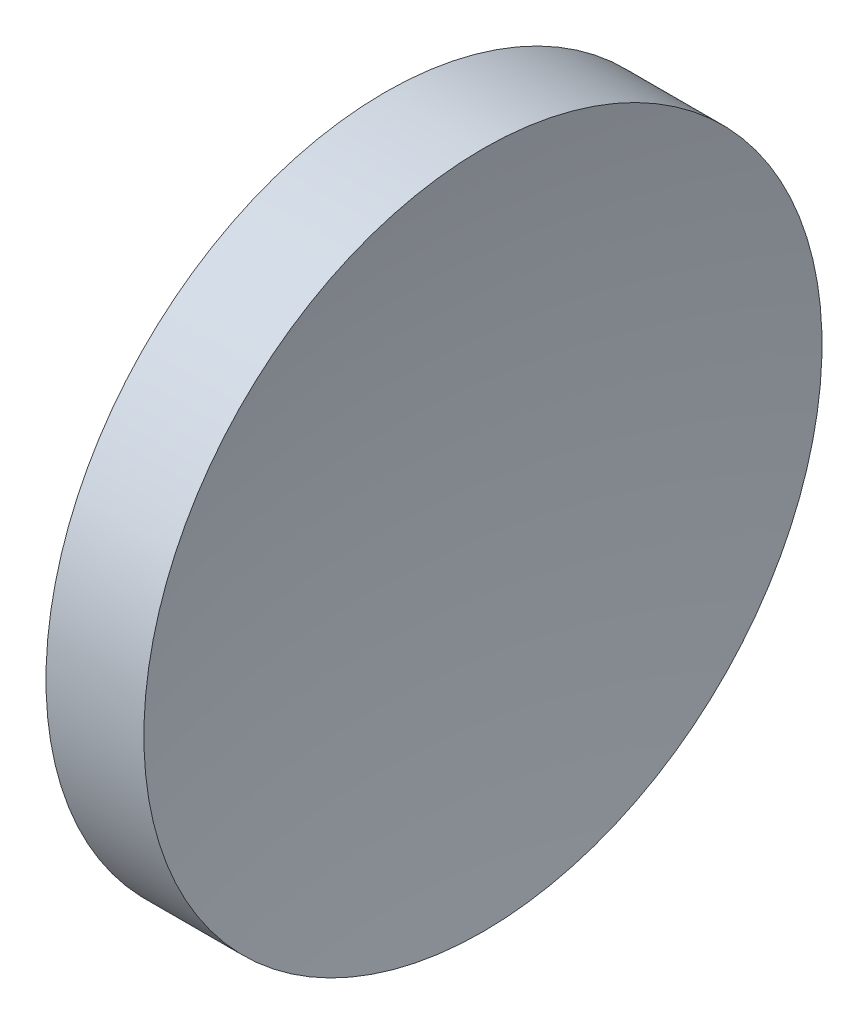
ISO-10303-21;
HEADER;
FILE_DESCRIPTION(('STEP AP214'),'2;1');
FILE_NAME('part.step','',(''),(''),'','','');
FILE_SCHEMA(('AUTOMOTIVE_DESIGN { 1 0 10303 214 1 1 1 1 }'));
ENDSEC;
DATA;
#1=APPLICATION_CONTEXT('core data for automotive mechanical design processes');
#2=APPLICATION_PROTOCOL_DEFINITION('international standard','automotive_design',2000,#1);
#3=PRODUCT_CONTEXT('',#1,'mechanical');
#4=PRODUCT('Part','Part','',(#3));
#5=PRODUCT_RELATED_PRODUCT_CATEGORY('part','',(#4));
#6=PRODUCT_DEFINITION_FORMATION('','',#4);
#7=PRODUCT_DEFINITION_CONTEXT('part definition',#1,'design');
#8=PRODUCT_DEFINITION('design','',#6,#7);
#9=PRODUCT_DEFINITION_SHAPE('','',#8);
#10=(LENGTH_UNIT() NAMED_UNIT(*) SI_UNIT(.MILLI.,.METRE.));
#11=(NAMED_UNIT(*) PLANE_ANGLE_UNIT() SI_UNIT($,.RADIAN.));
#12=(NAMED_UNIT(*) SI_UNIT($,.STERADIAN.) SOLID_ANGLE_UNIT());
#13=UNCERTAINTY_MEASURE_WITH_UNIT(LENGTH_MEASURE(1.E-05),#10,'distance_accuracy_value','');
#14=(GEOMETRIC_REPRESENTATION_CONTEXT(3) GLOBAL_UNCERTAINTY_ASSIGNED_CONTEXT((#13)) GLOBAL_UNIT_ASSIGNED_CONTEXT((#10,
#11,#12)) REPRESENTATION_CONTEXT('',''));
#15=CARTESIAN_POINT('',(0.,0.,0.));
#16=DIRECTION('',(0.,0.,1.));
#17=DIRECTION('',(1.,0.,0.));
#18=AXIS2_PLACEMENT_3D('',#15,#16,#17);
#19=CARTESIAN_POINT('',(206.236171093324,65.1574518265862,0.));
#20=DIRECTION('',(-1.,0.,0.));
#21=DIRECTION('',(0.,-1.,0.));
#22=AXIS2_PLACEMENT_3D('',#19,#20,#21);
#23=SPHERICAL_SURFACE('',#22,88.);
#24=CARTESIAN_POINT('',(119.893829220984,65.1574518265862,0.));
#25=DIRECTION('',(-1.,0.,0.));
#26=DIRECTION('',(0.,-1.,0.));
#27=AXIS2_PLACEMENT_3D('',#24,#25,#26);
#28=CIRCLE('',#27,17.);
#29=CARTESIAN_POINT('',(119.893829220984,48.1574518265862,0.));
#30=VERTEX_POINT('',#29);
#31=EDGE_CURVE('E10',#30,#30,#28,.T.);
#32=ORIENTED_EDGE('',*,*,#31,.F.);
#33=EDGE_LOOP('',(#32));
#34=FACE_BOUND('',#33,.T.);
#35=ADVANCED_FACE('F35',(#34),#23,.F.);
#36=CARTESIAN_POINT('',(110.014789248842,65.1574518265862,0.));
#37=DIRECTION('',(-1.,0.,0.));
#38=DIRECTION('',(0.,-1.,0.));
#39=AXIS2_PLACEMENT_3D('',#36,#37,#38);
#40=CYLINDRICAL_SURFACE('',#39,17.);
#41=CARTESIAN_POINT('',(114.986171093324,65.1574518265862,0.));
#42=DIRECTION('',(-1.,0.,0.));
#43=DIRECTION('',(0.,-1.,0.));
#44=AXIS2_PLACEMENT_3D('',#41,#42,#43);
#45=CIRCLE('',#44,17.);
#46=CARTESIAN_POINT('',(114.986171093324,48.1574518265862,0.));
#47=VERTEX_POINT('',#46);
#48=EDGE_CURVE('E41',#47,#47,#45,.T.);
#49=ORIENTED_EDGE('',*,*,#48,.F.);
#50=EDGE_LOOP('',(#49));
#51=FACE_BOUND('',#50,.T.);
#52=ORIENTED_EDGE('',*,*,#31,.T.);
#53=EDGE_LOOP('',(#52));
#54=FACE_BOUND('',#53,.T.);
#55=ADVANCED_FACE('F49',(#51,#54),#40,.T.);
#56=CARTESIAN_POINT('',(114.986171093324,65.1574518265862,0.));
#57=DIRECTION('',(1.,0.,0.));
#58=DIRECTION('',(0.,1.,0.));
#59=AXIS2_PLACEMENT_3D('',#56,#57,#58);
#60=PLANE('',#59);
#61=ORIENTED_EDGE('',*,*,#48,.T.);
#62=EDGE_LOOP('',(#61));
#63=FACE_BOUND('',#62,.T.);
#64=ADVANCED_FACE('F47',(#63),#60,.F.);
#65=CLOSED_SHELL('',(#35,#55,#64));
#66=MANIFOLD_SOLID_BREP('B2',#65);
#67=ADVANCED_BREP_SHAPE_REPRESENTATION('',(#18,#66),#14);
#68=SHAPE_DEFINITION_REPRESENTATION(#9,#67);
ENDSEC;
END-ISO-10303-21;
